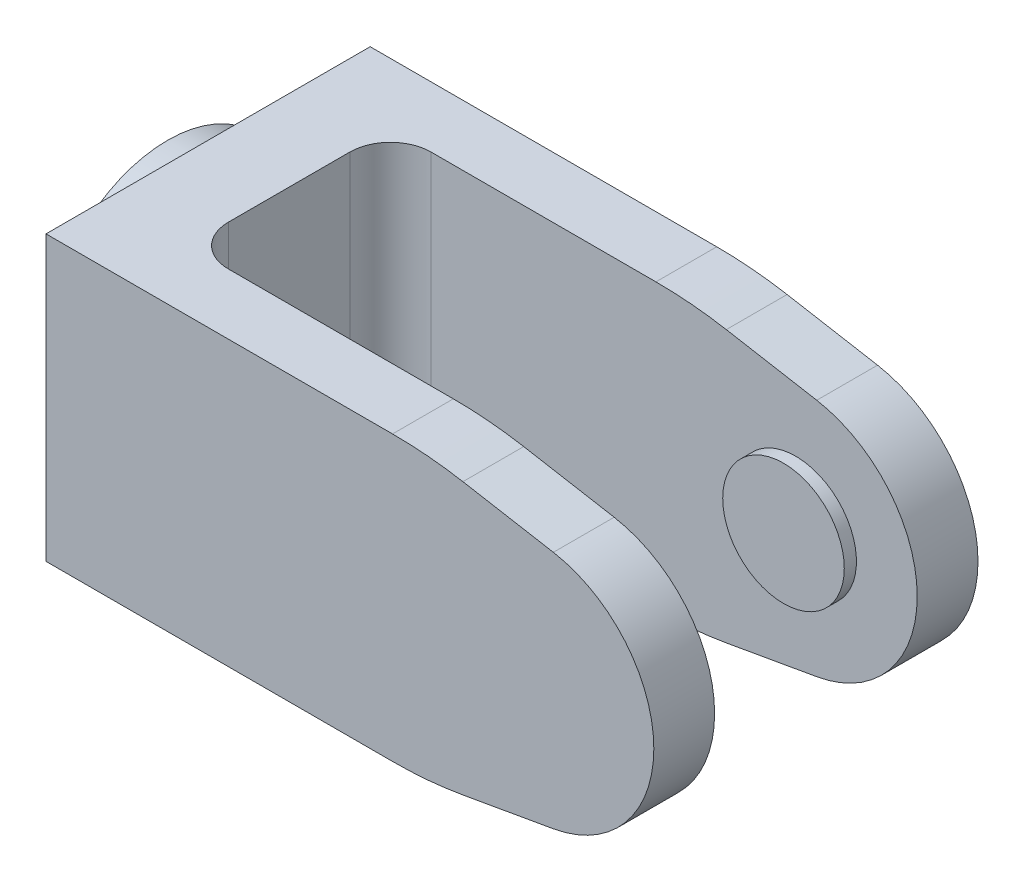
ISO-10303-21;
HEADER;
FILE_DESCRIPTION(('STEP AP214'),'2;1');
FILE_NAME('part.step','',(''),(''),'','','');
FILE_SCHEMA(('AUTOMOTIVE_DESIGN { 1 0 10303 214 1 1 1 1 }'));
ENDSEC;
DATA;
#1=APPLICATION_CONTEXT('core data for automotive mechanical design processes');
#2=APPLICATION_PROTOCOL_DEFINITION('international standard','automotive_design',2000,#1);
#3=PRODUCT_CONTEXT('',#1,'mechanical');
#4=PRODUCT('Part','Part','',(#3));
#5=PRODUCT_RELATED_PRODUCT_CATEGORY('part','',(#4));
#6=PRODUCT_DEFINITION_FORMATION('','',#4);
#7=PRODUCT_DEFINITION_CONTEXT('part definition',#1,'design');
#8=PRODUCT_DEFINITION('design','',#6,#7);
#9=PRODUCT_DEFINITION_SHAPE('','',#8);
#10=(LENGTH_UNIT() NAMED_UNIT(*) SI_UNIT(.MILLI.,.METRE.));
#11=(NAMED_UNIT(*) PLANE_ANGLE_UNIT() SI_UNIT($,.RADIAN.));
#12=(NAMED_UNIT(*) SI_UNIT($,.STERADIAN.) SOLID_ANGLE_UNIT());
#13=UNCERTAINTY_MEASURE_WITH_UNIT(LENGTH_MEASURE(1.E-05),#10,'distance_accuracy_value','');
#14=(GEOMETRIC_REPRESENTATION_CONTEXT(3) GLOBAL_UNCERTAINTY_ASSIGNED_CONTEXT((#13)) GLOBAL_UNIT_ASSIGNED_CONTEXT((#10,
#11,#12)) REPRESENTATION_CONTEXT('',''));
#15=CARTESIAN_POINT('',(0.,0.,0.));
#16=DIRECTION('',(0.,0.,1.));
#17=DIRECTION('',(1.,0.,0.));
#18=AXIS2_PLACEMENT_3D('',#15,#16,#17);
#19=CARTESIAN_POINT('',(65.8403220506079,-8.88482598258463,40.));
#20=DIRECTION('',(0.,0.,-1.));
#21=DIRECTION('',(-1.,0.,0.));
#22=AXIS2_PLACEMENT_3D('',#19,#20,#21);
#23=CYLINDRICAL_SURFACE('',#22,30.);
#24=CARTESIAN_POINT('',(65.8403220506079,-8.88482598258463,25.));
#25=DIRECTION('',(0.,0.,1.));
#26=DIRECTION('',(1.,0.,0.));
#27=AXIS2_PLACEMENT_3D('',#24,#25,#26);
#28=CIRCLE('',#27,30.);
#29=CARTESIAN_POINT('',(71.0497673806158,-38.4290585729509,25.));
#30=VERTEX_POINT('',#29);
#31=CARTESIAN_POINT('',(71.0497673806158,20.6594066077816,25.));
#32=VERTEX_POINT('',#31);
#33=EDGE_CURVE('E169',#30,#32,#28,.T.);
#34=ORIENTED_EDGE('',*,*,#33,.T.);
#35=DIRECTION('',(0.,0.,-1.));
#36=VECTOR('',#35,1.);
#37=CARTESIAN_POINT('',(71.0497673806158,20.6594066077816,40.));
#38=LINE('',#37,#36);
#39=CARTESIAN_POINT('',(71.0497673806158,20.6594066077816,40.));
#40=VERTEX_POINT('',#39);
#41=EDGE_CURVE('E185',#40,#32,#38,.T.);
#42=ORIENTED_EDGE('',*,*,#41,.F.);
#43=CARTESIAN_POINT('',(65.8403220506079,-8.88482598258463,40.));
#44=DIRECTION('',(0.,0.,1.));
#45=DIRECTION('',(1.,0.,0.));
#46=AXIS2_PLACEMENT_3D('',#43,#44,#45);
#47=CIRCLE('',#46,30.);
#48=CARTESIAN_POINT('',(71.0497673806158,-38.4290585729509,40.));
#49=VERTEX_POINT('',#48);
#50=EDGE_CURVE('E308',#49,#40,#47,.T.);
#51=ORIENTED_EDGE('',*,*,#50,.F.);
#52=DIRECTION('',(0.,0.,-1.));
#53=VECTOR('',#52,1.);
#54=CARTESIAN_POINT('',(71.0497673806158,-38.4290585729509,40.));
#55=LINE('',#54,#53);
#56=EDGE_CURVE('E195',#49,#30,#55,.T.);
#57=ORIENTED_EDGE('',*,*,#56,.T.);
#58=EDGE_LOOP('',(#34,#42,#51,#57));
#59=FACE_BOUND('',#58,.T.);
#60=ADVANCED_FACE('F33',(#59),#23,.T.);
#61=CARTESIAN_POINT('',(71.0497673806158,20.6594066077816,-25.));
#62=VERTEX_POINT('',#61);
#63=CARTESIAN_POINT('',(71.0497673806158,20.6594066077816,-40.));
#64=VERTEX_POINT('',#63);
#65=EDGE_CURVE('E174',#62,#64,#38,.T.);
#66=ORIENTED_EDGE('',*,*,#65,.F.);
#67=CARTESIAN_POINT('',(65.8403220506079,-8.88482598258463,-25.));
#68=DIRECTION('',(0.,0.,-1.));
#69=DIRECTION('',(-1.,0.,0.));
#70=AXIS2_PLACEMENT_3D('',#67,#68,#69);
#71=CIRCLE('',#70,30.);
#72=CARTESIAN_POINT('',(71.0497673806158,-38.4290585729509,-25.));
#73=VERTEX_POINT('',#72);
#74=EDGE_CURVE('E157',#62,#73,#71,.T.);
#75=ORIENTED_EDGE('',*,*,#74,.T.);
#76=CARTESIAN_POINT('',(71.0497673806158,-38.4290585729509,-40.));
#77=VERTEX_POINT('',#76);
#78=EDGE_CURVE('E189',#73,#77,#55,.T.);
#79=ORIENTED_EDGE('',*,*,#78,.T.);
#80=CARTESIAN_POINT('',(65.8403220506079,-8.88482598258463,-40.));
#81=DIRECTION('',(0.,0.,1.));
#82=DIRECTION('',(1.,0.,0.));
#83=AXIS2_PLACEMENT_3D('',#80,#81,#82);
#84=CIRCLE('',#83,30.);
#85=EDGE_CURVE('E183',#77,#64,#84,.T.);
#86=ORIENTED_EDGE('',*,*,#85,.T.);
#87=EDGE_LOOP('',(#66,#75,#79,#86));
#88=FACE_BOUND('',#87,.T.);
#89=ADVANCED_FACE('F181',(#88),#23,.T.);
#90=CARTESIAN_POINT('',(71.0497673806158,20.6594066077816,40.));
#91=DIRECTION('',(-0.173648177666931,-0.984807753012208,0.));
#92=DIRECTION('',(0.984807753012208,-0.173648177666931,0.));
#93=AXIS2_PLACEMENT_3D('',#90,#91,#92);
#94=PLANE('',#93);
#95=DIRECTION('',(0.984807753012208,-0.173648177666931,0.));
#96=VECTOR('',#95,1.);
#97=CARTESIAN_POINT('',(71.0497673806158,20.6594066077816,25.));
#98=LINE('',#97,#96);
#99=CARTESIAN_POINT('',(48.7245242723978,24.5959493186362,25.));
#100=VERTEX_POINT('',#99);
#101=EDGE_CURVE('E178',#100,#32,#98,.T.);
#102=ORIENTED_EDGE('',*,*,#101,.F.);
#103=DIRECTION('',(0.,0.,-1.));
#104=VECTOR('',#103,1.);
#105=CARTESIAN_POINT('',(48.7245242723978,24.5959493186362,40.));
#106=LINE('',#105,#104);
#107=CARTESIAN_POINT('',(48.7245242723978,24.5959493186362,40.));
#108=VERTEX_POINT('',#107);
#109=EDGE_CURVE('E215',#100,#108,#106,.F.);
#110=ORIENTED_EDGE('',*,*,#109,.T.);
#111=DIRECTION('',(-0.984807753012208,0.173648177666931,0.));
#112=VECTOR('',#111,1.);
#113=CARTESIAN_POINT('',(71.0497673806158,20.6594066077816,40.));
#114=LINE('',#113,#112);
#115=EDGE_CURVE('E310',#40,#108,#114,.T.);
#116=ORIENTED_EDGE('',*,*,#115,.F.);
#117=ORIENTED_EDGE('',*,*,#41,.T.);
#118=EDGE_LOOP('',(#102,#110,#116,#117));
#119=FACE_BOUND('',#118,.T.);
#120=ADVANCED_FACE('F346',(#119),#94,.F.);
#121=DIRECTION('',(-0.984807753012208,0.173648177666931,0.));
#122=VECTOR('',#121,1.);
#123=CARTESIAN_POINT('',(71.0497673806158,20.6594066077816,-40.));
#124=LINE('',#123,#122);
#125=CARTESIAN_POINT('',(48.7245242723978,24.5959493186362,-40.));
#126=VERTEX_POINT('',#125);
#127=EDGE_CURVE('E321',#64,#126,#124,.T.);
#128=ORIENTED_EDGE('',*,*,#127,.T.);
#129=DIRECTION('',(0.,0.,-1.));
#130=VECTOR('',#129,1.);
#131=CARTESIAN_POINT('',(48.7245242723978,24.5959493186362,40.));
#132=LINE('',#131,#130);
#133=CARTESIAN_POINT('',(48.7245242723978,24.5959493186362,-25.));
#134=VERTEX_POINT('',#133);
#135=EDGE_CURVE('E177',#126,#134,#132,.F.);
#136=ORIENTED_EDGE('',*,*,#135,.T.);
#137=DIRECTION('',(-0.984807753012208,0.173648177666931,0.));
#138=VECTOR('',#137,1.);
#139=CARTESIAN_POINT('',(71.0497673806158,20.6594066077816,-25.));
#140=LINE('',#139,#138);
#141=EDGE_CURVE('E160',#62,#134,#140,.T.);
#142=ORIENTED_EDGE('',*,*,#141,.F.);
#143=ORIENTED_EDGE('',*,*,#65,.T.);
#144=EDGE_LOOP('',(#128,#136,#142,#143));
#145=FACE_BOUND('',#144,.T.);
#146=ADVANCED_FACE('F173',(#145),#94,.F.);
#147=CARTESIAN_POINT('',(40.1085728582971,26.1151740174154,40.));
#148=DIRECTION('',(0.,-1.,0.));
#149=DIRECTION('',(1.,0.,0.));
#150=AXIS2_PLACEMENT_3D('',#147,#148,#149);
#151=PLANE('',#150);
#152=DIRECTION('',(-1.,0.,0.));
#153=VECTOR('',#152,1.);
#154=CARTESIAN_POINT('',(40.1085728582971,26.1151740174154,40.));
#155=LINE('',#154,#153);
#156=CARTESIAN_POINT('',(31.3597065057047,26.1151740174154,40.));
#157=VERTEX_POINT('',#156);
#158=CARTESIAN_POINT('',(-54.1596779493921,26.1151740174154,40.));
#159=VERTEX_POINT('',#158);
#160=EDGE_CURVE('E191',#157,#159,#155,.T.);
#161=ORIENTED_EDGE('',*,*,#160,.F.);
#162=DIRECTION('',(0.,0.,-1.));
#163=VECTOR('',#162,1.);
#164=CARTESIAN_POINT('',(31.3597065057047,26.1151740174154,40.));
#165=LINE('',#164,#163);
#166=CARTESIAN_POINT('',(31.3597065057046,26.1151740174154,25.));
#167=VERTEX_POINT('',#166);
#168=EDGE_CURVE('E209',#157,#167,#165,.T.);
#169=ORIENTED_EDGE('',*,*,#168,.T.);
#170=DIRECTION('',(1.,0.,0.));
#171=VECTOR('',#170,1.);
#172=CARTESIAN_POINT('',(-34.1596779493921,26.1151740174154,25.));
#173=LINE('',#172,#171);
#174=CARTESIAN_POINT('',(-24.1596779493921,26.1151740174154,25.));
#175=VERTEX_POINT('',#174);
#176=EDGE_CURVE('E279',#175,#167,#173,.T.);
#177=ORIENTED_EDGE('',*,*,#176,.F.);
#178=CARTESIAN_POINT('',(-24.1596779493921,26.1151740174154,15.));
#179=DIRECTION('',(0.,-1.,0.));
#180=DIRECTION('',(1.,0.,0.));
#181=AXIS2_PLACEMENT_3D('',#178,#179,#180);
#182=CIRCLE('',#181,10.);
#183=CARTESIAN_POINT('',(-34.1596779493921,26.1151740174154,15.));
#184=VERTEX_POINT('',#183);
#185=EDGE_CURVE('E252',#175,#184,#182,.T.);
#186=ORIENTED_EDGE('',*,*,#185,.T.);
#187=DIRECTION('',(0.,0.,1.));
#188=VECTOR('',#187,1.);
#189=CARTESIAN_POINT('',(-34.1596779493921,26.1151740174154,-25.));
#190=LINE('',#189,#188);
#191=CARTESIAN_POINT('',(-34.1596779493921,26.1151740174154,-15.));
#192=VERTEX_POINT('',#191);
#193=EDGE_CURVE('E278',#192,#184,#190,.T.);
#194=ORIENTED_EDGE('',*,*,#193,.F.);
#195=CARTESIAN_POINT('',(-24.1596779493921,26.1151740174154,-15.));
#196=DIRECTION('',(0.,-1.,0.));
#197=DIRECTION('',(1.,0.,0.));
#198=AXIS2_PLACEMENT_3D('',#195,#196,#197);
#199=CIRCLE('',#198,10.);
#200=CARTESIAN_POINT('',(-24.1596779493921,26.1151740174154,-25.));
#201=VERTEX_POINT('',#200);
#202=EDGE_CURVE('E41',#192,#201,#199,.T.);
#203=ORIENTED_EDGE('',*,*,#202,.T.);
#204=DIRECTION('',(-1.,0.,0.));
#205=VECTOR('',#204,1.);
#206=CARTESIAN_POINT('',(-34.1596779493921,26.1151740174154,-25.));
#207=LINE('',#206,#205);
#208=CARTESIAN_POINT('',(31.3597065057047,26.1151740174154,-25.));
#209=VERTEX_POINT('',#208);
#210=EDGE_CURVE('E179',#209,#201,#207,.T.);
#211=ORIENTED_EDGE('',*,*,#210,.F.);
#212=DIRECTION('',(0.,0.,-1.));
#213=VECTOR('',#212,1.);
#214=CARTESIAN_POINT('',(31.3597065057047,26.1151740174154,40.));
#215=LINE('',#214,#213);
#216=CARTESIAN_POINT('',(31.3597065057047,26.1151740174154,-40.));
#217=VERTEX_POINT('',#216);
#218=EDGE_CURVE('E206',#209,#217,#215,.T.);
#219=ORIENTED_EDGE('',*,*,#218,.T.);
#220=DIRECTION('',(-1.,0.,0.));
#221=VECTOR('',#220,1.);
#222=CARTESIAN_POINT('',(40.1085728582971,26.1151740174154,-40.));
#223=LINE('',#222,#221);
#224=CARTESIAN_POINT('',(-54.1596779493921,26.1151740174154,-40.));
#225=VERTEX_POINT('',#224);
#226=EDGE_CURVE('E303',#217,#225,#223,.T.);
#227=ORIENTED_EDGE('',*,*,#226,.T.);
#228=DIRECTION('',(0.,0.,-1.));
#229=VECTOR('',#228,1.);
#230=CARTESIAN_POINT('',(-54.1596779493921,26.1151740174154,40.));
#231=LINE('',#230,#229);
#232=EDGE_CURVE('E186',#159,#225,#231,.T.);
#233=ORIENTED_EDGE('',*,*,#232,.F.);
#234=EDGE_LOOP('',(#161,#169,#177,#186,#194,#203,#211,#219,#227,#233));
#235=FACE_BOUND('',#234,.T.);
#236=ADVANCED_FACE('F277',(#235),#151,.F.);
#237=CARTESIAN_POINT('',(40.1085728582971,-43.8848259825847,40.));
#238=DIRECTION('',(-0.173648177666931,0.984807753012208,0.));
#239=DIRECTION('',(-0.984807753012208,-0.173648177666931,0.));
#240=AXIS2_PLACEMENT_3D('',#237,#238,#239);
#241=PLANE('',#240);
#242=DIRECTION('',(-0.984807753012208,-0.173648177666931,0.));
#243=VECTOR('',#242,1.);
#244=CARTESIAN_POINT('',(40.1085728582971,-43.8848259825847,-25.));
#245=LINE('',#244,#243);
#246=CARTESIAN_POINT('',(48.7245242723978,-42.3656012838055,-25.));
#247=VERTEX_POINT('',#246);
#248=EDGE_CURVE('E163',#73,#247,#245,.T.);
#249=ORIENTED_EDGE('',*,*,#248,.T.);
#250=DIRECTION('',(0.,0.,-1.));
#251=VECTOR('',#250,1.);
#252=CARTESIAN_POINT('',(48.7245242723978,-42.3656012838055,40.));
#253=LINE('',#252,#251);
#254=CARTESIAN_POINT('',(48.7245242723978,-42.3656012838055,-40.));
#255=VERTEX_POINT('',#254);
#256=EDGE_CURVE('E224',#247,#255,#253,.T.);
#257=ORIENTED_EDGE('',*,*,#256,.T.);
#258=DIRECTION('',(0.984807753012208,0.173648177666931,0.));
#259=VECTOR('',#258,1.);
#260=CARTESIAN_POINT('',(40.1085728582971,-43.8848259825847,-40.));
#261=LINE('',#260,#259);
#262=EDGE_CURVE('E318',#255,#77,#261,.T.);
#263=ORIENTED_EDGE('',*,*,#262,.T.);
#264=ORIENTED_EDGE('',*,*,#78,.F.);
#265=EDGE_LOOP('',(#249,#257,#263,#264));
#266=FACE_BOUND('',#265,.T.);
#267=ADVANCED_FACE('F378',(#266),#241,.F.);
#268=CARTESIAN_POINT('',(-54.1596779493921,26.1151740174154,40.));
#269=DIRECTION('',(1.,0.,0.));
#270=DIRECTION('',(0.,1.,0.));
#271=AXIS2_PLACEMENT_3D('',#268,#269,#270);
#272=PLANE('',#271);
#273=CARTESIAN_POINT('',(-54.1596779493921,-8.88482598258465,0.));
#274=DIRECTION('',(-1.,0.,0.));
#275=DIRECTION('',(0.,-1.,0.));
#276=AXIS2_PLACEMENT_3D('',#273,#274,#275);
#277=CIRCLE('',#276,30.);
#278=CARTESIAN_POINT('',(-54.1596779493921,-38.8848259825847,0.));
#279=VERTEX_POINT('',#278);
#280=EDGE_CURVE('E205',#279,#279,#277,.T.);
#281=ORIENTED_EDGE('',*,*,#280,.F.);
#282=EDGE_LOOP('',(#281));
#283=FACE_BOUND('',#282,.T.);
#284=DIRECTION('',(0.,-1.,0.));
#285=VECTOR('',#284,1.);
#286=CARTESIAN_POINT('',(-54.1596779493921,26.1151740174154,-40.));
#287=LINE('',#286,#285);
#288=CARTESIAN_POINT('',(-54.1596779493921,-43.8848259825847,-40.));
#289=VERTEX_POINT('',#288);
#290=EDGE_CURVE('E298',#225,#289,#287,.T.);
#291=ORIENTED_EDGE('',*,*,#290,.T.);
#292=DIRECTION('',(0.,0.,-1.));
#293=VECTOR('',#292,1.);
#294=CARTESIAN_POINT('',(-54.1596779493921,-43.8848259825847,40.));
#295=LINE('',#294,#293);
#296=CARTESIAN_POINT('',(-54.1596779493921,-43.8848259825847,40.));
#297=VERTEX_POINT('',#296);
#298=EDGE_CURVE('E198',#297,#289,#295,.T.);
#299=ORIENTED_EDGE('',*,*,#298,.F.);
#300=DIRECTION('',(0.,-1.,0.));
#301=VECTOR('',#300,1.);
#302=CARTESIAN_POINT('',(-54.1596779493921,26.1151740174154,40.));
#303=LINE('',#302,#301);
#304=EDGE_CURVE('E299',#159,#297,#303,.T.);
#305=ORIENTED_EDGE('',*,*,#304,.F.);
#306=ORIENTED_EDGE('',*,*,#232,.T.);
#307=EDGE_LOOP('',(#291,#299,#305,#306));
#308=FACE_BOUND('',#307,.T.);
#309=ADVANCED_FACE('F329',(#283,#308),#272,.F.);
#310=CARTESIAN_POINT('',(-54.1596779493921,-43.8848259825847,40.));
#311=DIRECTION('',(0.,1.,0.));
#312=DIRECTION('',(0.,0.,1.));
#313=AXIS2_PLACEMENT_3D('',#310,#311,#312);
#314=PLANE('',#313);
#315=DIRECTION('',(1.,0.,0.));
#316=VECTOR('',#315,1.);
#317=CARTESIAN_POINT('',(-54.1596779493921,-43.8848259825847,-40.));
#318=LINE('',#317,#316);
#319=CARTESIAN_POINT('',(31.3597065057046,-43.8848259825847,-40.));
#320=VERTEX_POINT('',#319);
#321=EDGE_CURVE('E316',#289,#320,#318,.T.);
#322=ORIENTED_EDGE('',*,*,#321,.T.);
#323=DIRECTION('',(0.,0.,-1.));
#324=VECTOR('',#323,1.);
#325=CARTESIAN_POINT('',(31.3597065057046,-43.8848259825847,40.));
#326=LINE('',#325,#324);
#327=CARTESIAN_POINT('',(31.3597065057046,-43.8848259825847,-25.));
#328=VERTEX_POINT('',#327);
#329=EDGE_CURVE('E231',#320,#328,#326,.F.);
#330=ORIENTED_EDGE('',*,*,#329,.T.);
#331=DIRECTION('',(-1.,0.,0.));
#332=VECTOR('',#331,1.);
#333=CARTESIAN_POINT('',(-34.1596779493921,-43.8848259825847,-25.));
#334=LINE('',#333,#332);
#335=CARTESIAN_POINT('',(-24.1596779493921,-43.8848259825847,-25.));
#336=VERTEX_POINT('',#335);
#337=EDGE_CURVE('E272',#328,#336,#334,.T.);
#338=ORIENTED_EDGE('',*,*,#337,.T.);
#339=CARTESIAN_POINT('',(-24.1596779493921,-43.8848259825847,-15.));
#340=DIRECTION('',(0.,1.,0.));
#341=DIRECTION('',(0.,0.,1.));
#342=AXIS2_PLACEMENT_3D('',#339,#340,#341);
#343=CIRCLE('',#342,10.);
#344=CARTESIAN_POINT('',(-34.1596779493921,-43.8848259825847,-15.));
#345=VERTEX_POINT('',#344);
#346=EDGE_CURVE('E11',#336,#345,#343,.T.);
#347=ORIENTED_EDGE('',*,*,#346,.T.);
#348=DIRECTION('',(0.,0.,1.));
#349=VECTOR('',#348,1.);
#350=CARTESIAN_POINT('',(-34.1596779493921,-43.8848259825847,-25.));
#351=LINE('',#350,#349);
#352=CARTESIAN_POINT('',(-34.1596779493921,-43.8848259825847,15.));
#353=VERTEX_POINT('',#352);
#354=EDGE_CURVE('E263',#345,#353,#351,.T.);
#355=ORIENTED_EDGE('',*,*,#354,.T.);
#356=CARTESIAN_POINT('',(-24.1596779493921,-43.8848259825847,15.));
#357=DIRECTION('',(0.,1.,0.));
#358=DIRECTION('',(0.,0.,1.));
#359=AXIS2_PLACEMENT_3D('',#356,#357,#358);
#360=CIRCLE('',#359,10.);
#361=CARTESIAN_POINT('',(-24.1596779493921,-43.8848259825847,25.));
#362=VERTEX_POINT('',#361);
#363=EDGE_CURVE('E254',#353,#362,#360,.T.);
#364=ORIENTED_EDGE('',*,*,#363,.T.);
#365=DIRECTION('',(1.,0.,0.));
#366=VECTOR('',#365,1.);
#367=CARTESIAN_POINT('',(-34.1596779493921,-43.8848259825847,25.));
#368=LINE('',#367,#366);
#369=CARTESIAN_POINT('',(31.3597065057046,-43.8848259825847,25.));
#370=VERTEX_POINT('',#369);
#371=EDGE_CURVE('E261',#362,#370,#368,.T.);
#372=ORIENTED_EDGE('',*,*,#371,.T.);
#373=DIRECTION('',(0.,0.,-1.));
#374=VECTOR('',#373,1.);
#375=CARTESIAN_POINT('',(31.3597065057046,-43.8848259825847,40.));
#376=LINE('',#375,#374);
#377=CARTESIAN_POINT('',(31.3597065057046,-43.8848259825847,40.));
#378=VERTEX_POINT('',#377);
#379=EDGE_CURVE('E229',#370,#378,#376,.F.);
#380=ORIENTED_EDGE('',*,*,#379,.T.);
#381=DIRECTION('',(1.,0.,0.));
#382=VECTOR('',#381,1.);
#383=CARTESIAN_POINT('',(-54.1596779493921,-43.8848259825847,40.));
#384=LINE('',#383,#382);
#385=EDGE_CURVE('E302',#297,#378,#384,.T.);
#386=ORIENTED_EDGE('',*,*,#385,.F.);
#387=ORIENTED_EDGE('',*,*,#298,.T.);
#388=EDGE_LOOP('',(#322,#330,#338,#347,#355,#364,#372,#380,#386,#387));
#389=FACE_BOUND('',#388,.T.);
#390=ADVANCED_FACE('F260',(#389),#314,.F.);
#391=DIRECTION('',(0.984807753012208,0.173648177666931,0.));
#392=VECTOR('',#391,1.);
#393=CARTESIAN_POINT('',(40.1085728582971,-43.8848259825847,40.));
#394=LINE('',#393,#392);
#395=CARTESIAN_POINT('',(48.7245242723978,-42.3656012838055,40.));
#396=VERTEX_POINT('',#395);
#397=EDGE_CURVE('E306',#396,#49,#394,.T.);
#398=ORIENTED_EDGE('',*,*,#397,.F.);
#399=DIRECTION('',(0.,0.,-1.));
#400=VECTOR('',#399,1.);
#401=CARTESIAN_POINT('',(48.7245242723978,-42.3656012838055,40.));
#402=LINE('',#401,#400);
#403=CARTESIAN_POINT('',(48.7245242723978,-42.3656012838055,25.));
#404=VERTEX_POINT('',#403);
#405=EDGE_CURVE('E235',#396,#404,#402,.T.);
#406=ORIENTED_EDGE('',*,*,#405,.T.);
#407=DIRECTION('',(0.984807753012208,0.173648177666931,0.));
#408=VECTOR('',#407,1.);
#409=CARTESIAN_POINT('',(40.1085728582971,-43.8848259825847,25.));
#410=LINE('',#409,#408);
#411=EDGE_CURVE('E295',#404,#30,#410,.T.);
#412=ORIENTED_EDGE('',*,*,#411,.T.);
#413=ORIENTED_EDGE('',*,*,#56,.F.);
#414=EDGE_LOOP('',(#398,#406,#412,#413));
#415=FACE_BOUND('',#414,.T.);
#416=ADVANCED_FACE('F354',(#415),#241,.F.);
#417=CARTESIAN_POINT('',(65.8403220506079,-8.88482598258463,40.));
#418=DIRECTION('',(0.,0.,1.));
#419=DIRECTION('',(1.,0.,0.));
#420=AXIS2_PLACEMENT_3D('',#417,#418,#419);
#421=PLANE('',#420);
#422=ORIENTED_EDGE('',*,*,#385,.T.);
#423=CARTESIAN_POINT('',(31.3597065057046,56.1151740174153,40.));
#424=DIRECTION('',(0.,0.,1.));
#425=DIRECTION('',(1.,0.,0.));
#426=AXIS2_PLACEMENT_3D('',#423,#424,#425);
#427=CIRCLE('',#426,100.);
#428=EDGE_CURVE('E241',#378,#396,#427,.T.);
#429=ORIENTED_EDGE('',*,*,#428,.T.);
#430=ORIENTED_EDGE('',*,*,#397,.T.);
#431=ORIENTED_EDGE('',*,*,#50,.T.);
#432=ORIENTED_EDGE('',*,*,#115,.T.);
#433=CARTESIAN_POINT('',(31.3597065057047,-73.8848259825846,40.));
#434=DIRECTION('',(0.,0.,1.));
#435=DIRECTION('',(1.,0.,0.));
#436=AXIS2_PLACEMENT_3D('',#433,#434,#435);
#437=CIRCLE('',#436,100.);
#438=EDGE_CURVE('E217',#108,#157,#437,.T.);
#439=ORIENTED_EDGE('',*,*,#438,.T.);
#440=ORIENTED_EDGE('',*,*,#160,.T.);
#441=ORIENTED_EDGE('',*,*,#304,.T.);
#442=EDGE_LOOP('',(#422,#429,#430,#431,#432,#439,#440,#441));
#443=FACE_BOUND('',#442,.T.);
#444=ADVANCED_FACE('F336',(#443),#421,.T.);
#445=CARTESIAN_POINT('',(65.8403220506079,-8.88482598258463,-40.));
#446=DIRECTION('',(0.,0.,1.));
#447=DIRECTION('',(1.,0.,0.));
#448=AXIS2_PLACEMENT_3D('',#445,#446,#447);
#449=PLANE('',#448);
#450=ORIENTED_EDGE('',*,*,#262,.F.);
#451=CARTESIAN_POINT('',(31.3597065057046,56.1151740174153,-40.));
#452=DIRECTION('',(0.,0.,1.));
#453=DIRECTION('',(1.,0.,0.));
#454=AXIS2_PLACEMENT_3D('',#451,#452,#453);
#455=CIRCLE('',#454,100.);
#456=EDGE_CURVE('E227',#255,#320,#455,.F.);
#457=ORIENTED_EDGE('',*,*,#456,.T.);
#458=ORIENTED_EDGE('',*,*,#321,.F.);
#459=ORIENTED_EDGE('',*,*,#290,.F.);
#460=ORIENTED_EDGE('',*,*,#226,.F.);
#461=CARTESIAN_POINT('',(31.3597065057047,-73.8848259825846,-40.));
#462=DIRECTION('',(0.,0.,1.));
#463=DIRECTION('',(1.,0.,0.));
#464=AXIS2_PLACEMENT_3D('',#461,#462,#463);
#465=CIRCLE('',#464,100.);
#466=EDGE_CURVE('E219',#217,#126,#465,.F.);
#467=ORIENTED_EDGE('',*,*,#466,.T.);
#468=ORIENTED_EDGE('',*,*,#127,.F.);
#469=ORIENTED_EDGE('',*,*,#85,.F.);
#470=EDGE_LOOP('',(#450,#457,#458,#459,#460,#467,#468,#469));
#471=FACE_BOUND('',#470,.T.);
#472=ADVANCED_FACE('F332',(#471),#449,.F.);
#473=CARTESIAN_POINT('',(-34.1596779493921,-43.8848259825847,-25.));
#474=DIRECTION('',(0.,0.,-1.));
#475=DIRECTION('',(-1.,0.,0.));
#476=AXIS2_PLACEMENT_3D('',#473,#474,#475);
#477=PLANE('',#476);
#478=CARTESIAN_POINT('',(65.8403220506079,-8.88482598258463,-25.));
#479=DIRECTION('',(0.,0.,-1.));
#480=DIRECTION('',(-1.,0.,0.));
#481=AXIS2_PLACEMENT_3D('',#478,#479,#480);
#482=CIRCLE('',#481,15.);
#483=CARTESIAN_POINT('',(50.8403220506079,-8.88482598258463,-25.));
#484=VERTEX_POINT('',#483);
#485=EDGE_CURVE('E168',#484,#484,#482,.F.);
#486=ORIENTED_EDGE('',*,*,#485,.F.);
#487=EDGE_LOOP('',(#486));
#488=FACE_BOUND('',#487,.T.);
#489=ORIENTED_EDGE('',*,*,#210,.T.);
#490=DIRECTION('',(0.,1.,0.));
#491=VECTOR('',#490,1.);
#492=CARTESIAN_POINT('',(-24.1596779493921,-43.8848259825847,-25.));
#493=LINE('',#492,#491);
#494=EDGE_CURVE('E54',#201,#336,#493,.F.);
#495=ORIENTED_EDGE('',*,*,#494,.T.);
#496=ORIENTED_EDGE('',*,*,#337,.F.);
#497=CARTESIAN_POINT('',(31.3597065057046,56.1151740174153,-25.));
#498=DIRECTION('',(0.,0.,-1.));
#499=DIRECTION('',(-1.,0.,0.));
#500=AXIS2_PLACEMENT_3D('',#497,#498,#499);
#501=CIRCLE('',#500,100.);
#502=EDGE_CURVE('E233',#328,#247,#501,.F.);
#503=ORIENTED_EDGE('',*,*,#502,.T.);
#504=ORIENTED_EDGE('',*,*,#248,.F.);
#505=ORIENTED_EDGE('',*,*,#74,.F.);
#506=ORIENTED_EDGE('',*,*,#141,.T.);
#507=CARTESIAN_POINT('',(31.3597065057047,-73.8848259825846,-25.));
#508=DIRECTION('',(0.,0.,-1.));
#509=DIRECTION('',(-1.,0.,0.));
#510=AXIS2_PLACEMENT_3D('',#507,#508,#509);
#511=CIRCLE('',#510,100.);
#512=EDGE_CURVE('E222',#134,#209,#511,.F.);
#513=ORIENTED_EDGE('',*,*,#512,.T.);
#514=EDGE_LOOP('',(#489,#495,#496,#503,#504,#505,#506,#513));
#515=FACE_BOUND('',#514,.T.);
#516=ADVANCED_FACE('F159',(#488,#515),#477,.F.);
#517=CARTESIAN_POINT('',(-34.1596779493921,-43.8848259825847,25.));
#518=DIRECTION('',(0.,0.,1.));
#519=DIRECTION('',(1.,0.,0.));
#520=AXIS2_PLACEMENT_3D('',#517,#518,#519);
#521=PLANE('',#520);
#522=CARTESIAN_POINT('',(65.8403220506079,-8.88482598258463,25.));
#523=DIRECTION('',(0.,0.,1.));
#524=DIRECTION('',(1.,0.,0.));
#525=AXIS2_PLACEMENT_3D('',#522,#523,#524);
#526=CIRCLE('',#525,15.);
#527=CARTESIAN_POINT('',(80.8403220506079,-8.88482598258463,25.));
#528=VERTEX_POINT('',#527);
#529=EDGE_CURVE('E454',#528,#528,#526,.T.);
#530=ORIENTED_EDGE('',*,*,#529,.T.);
#531=EDGE_LOOP('',(#530));
#532=FACE_BOUND('',#531,.T.);
#533=ORIENTED_EDGE('',*,*,#371,.F.);
#534=DIRECTION('',(0.,1.,0.));
#535=VECTOR('',#534,1.);
#536=CARTESIAN_POINT('',(-24.1596779493921,26.1151740174154,25.));
#537=LINE('',#536,#535);
#538=EDGE_CURVE('E243',#362,#175,#537,.T.);
#539=ORIENTED_EDGE('',*,*,#538,.T.);
#540=ORIENTED_EDGE('',*,*,#176,.T.);
#541=CARTESIAN_POINT('',(31.3597065057047,-73.8848259825846,25.));
#542=DIRECTION('',(0.,0.,1.));
#543=DIRECTION('',(1.,0.,0.));
#544=AXIS2_PLACEMENT_3D('',#541,#542,#543);
#545=CIRCLE('',#544,100.);
#546=EDGE_CURVE('E213',#167,#100,#545,.F.);
#547=ORIENTED_EDGE('',*,*,#546,.T.);
#548=ORIENTED_EDGE('',*,*,#101,.T.);
#549=ORIENTED_EDGE('',*,*,#33,.F.);
#550=ORIENTED_EDGE('',*,*,#411,.F.);
#551=CARTESIAN_POINT('',(31.3597065057046,56.1151740174153,25.));
#552=DIRECTION('',(0.,0.,1.));
#553=DIRECTION('',(1.,0.,0.));
#554=AXIS2_PLACEMENT_3D('',#551,#552,#553);
#555=CIRCLE('',#554,100.);
#556=EDGE_CURVE('E238',#404,#370,#555,.F.);
#557=ORIENTED_EDGE('',*,*,#556,.T.);
#558=EDGE_LOOP('',(#533,#539,#540,#547,#548,#549,#550,#557));
#559=FACE_BOUND('',#558,.T.);
#560=ADVANCED_FACE('F268',(#532,#559),#521,.F.);
#561=CARTESIAN_POINT('',(-34.1596779493921,-43.8848259825847,-25.));
#562=DIRECTION('',(-1.,0.,0.));
#563=DIRECTION('',(0.,0.,1.));
#564=AXIS2_PLACEMENT_3D('',#561,#562,#563);
#565=PLANE('',#564);
#566=ORIENTED_EDGE('',*,*,#193,.T.);
#567=DIRECTION('',(0.,1.,0.));
#568=VECTOR('',#567,1.);
#569=CARTESIAN_POINT('',(-34.1596779493921,-43.8848259825847,15.));
#570=LINE('',#569,#568);
#571=EDGE_CURVE('E249',#184,#353,#570,.F.);
#572=ORIENTED_EDGE('',*,*,#571,.T.);
#573=ORIENTED_EDGE('',*,*,#354,.F.);
#574=DIRECTION('',(0.,1.,0.));
#575=VECTOR('',#574,1.);
#576=CARTESIAN_POINT('',(-34.1596779493921,26.1151740174154,-15.));
#577=LINE('',#576,#575);
#578=EDGE_CURVE('E246',#345,#192,#577,.T.);
#579=ORIENTED_EDGE('',*,*,#578,.T.);
#580=EDGE_LOOP('',(#566,#572,#573,#579));
#581=FACE_BOUND('',#580,.T.);
#582=ADVANCED_FACE('F281',(#581),#565,.F.);
#583=CARTESIAN_POINT('',(65.8403220506079,-8.88482598258463,-22.));
#584=DIRECTION('',(0.,0.,-1.));
#585=DIRECTION('',(-1.,0.,0.));
#586=AXIS2_PLACEMENT_3D('',#583,#584,#585);
#587=CYLINDRICAL_SURFACE('',#586,15.);
#588=CARTESIAN_POINT('',(65.8403220506079,-8.88482598258463,-22.));
#589=DIRECTION('',(0.,0.,1.));
#590=DIRECTION('',(1.,0.,0.));
#591=AXIS2_PLACEMENT_3D('',#588,#589,#590);
#592=CIRCLE('',#591,15.);
#593=CARTESIAN_POINT('',(80.8403220506079,-8.88482598258463,-22.));
#594=VERTEX_POINT('',#593);
#595=EDGE_CURVE('E283',#594,#594,#592,.T.);
#596=ORIENTED_EDGE('',*,*,#595,.F.);
#597=EDGE_LOOP('',(#596));
#598=FACE_BOUND('',#597,.T.);
#599=ORIENTED_EDGE('',*,*,#485,.T.);
#600=EDGE_LOOP('',(#599));
#601=FACE_BOUND('',#600,.T.);
#602=ADVANCED_FACE('F410',(#598,#601),#587,.T.);
#603=CARTESIAN_POINT('',(65.8403220506079,-8.88482598258463,-22.));
#604=DIRECTION('',(0.,0.,1.));
#605=DIRECTION('',(1.,0.,0.));
#606=AXIS2_PLACEMENT_3D('',#603,#604,#605);
#607=PLANE('',#606);
#608=ORIENTED_EDGE('',*,*,#595,.T.);
#609=EDGE_LOOP('',(#608));
#610=FACE_BOUND('',#609,.T.);
#611=ADVANCED_FACE('F419',(#610),#607,.T.);
#612=CARTESIAN_POINT('',(65.8403220506079,-8.88482598258463,22.));
#613=DIRECTION('',(0.,0.,1.));
#614=DIRECTION('',(1.,0.,0.));
#615=AXIS2_PLACEMENT_3D('',#612,#613,#614);
#616=CYLINDRICAL_SURFACE('',#615,15.);
#617=CARTESIAN_POINT('',(65.8403220506079,-8.88482598258463,22.));
#618=DIRECTION('',(0.,0.,1.));
#619=DIRECTION('',(1.,0.,0.));
#620=AXIS2_PLACEMENT_3D('',#617,#618,#619);
#621=CIRCLE('',#620,15.);
#622=CARTESIAN_POINT('',(80.8403220506079,-8.88482598258463,22.));
#623=VERTEX_POINT('',#622);
#624=EDGE_CURVE('E287',#623,#623,#621,.T.);
#625=ORIENTED_EDGE('',*,*,#624,.T.);
#626=EDGE_LOOP('',(#625));
#627=FACE_BOUND('',#626,.T.);
#628=ORIENTED_EDGE('',*,*,#529,.F.);
#629=EDGE_LOOP('',(#628));
#630=FACE_BOUND('',#629,.T.);
#631=ADVANCED_FACE('F423',(#627,#630),#616,.T.);
#632=CARTESIAN_POINT('',(65.8403220506079,-8.88482598258463,22.));
#633=DIRECTION('',(0.,0.,-1.));
#634=DIRECTION('',(1.,0.,0.));
#635=AXIS2_PLACEMENT_3D('',#632,#633,#634);
#636=PLANE('',#635);
#637=ORIENTED_EDGE('',*,*,#624,.F.);
#638=EDGE_LOOP('',(#637));
#639=FACE_BOUND('',#638,.T.);
#640=ADVANCED_FACE('F427',(#639),#636,.T.);
#641=CARTESIAN_POINT('',(-64.1596779493921,-8.88482598258465,0.));
#642=DIRECTION('',(1.,0.,0.));
#643=DIRECTION('',(0.,1.,0.));
#644=AXIS2_PLACEMENT_3D('',#641,#642,#643);
#645=CYLINDRICAL_SURFACE('',#644,30.);
#646=CARTESIAN_POINT('',(-64.1596779493921,-8.88482598258465,0.));
#647=DIRECTION('',(-1.,0.,0.));
#648=DIRECTION('',(0.,-1.,0.));
#649=AXIS2_PLACEMENT_3D('',#646,#647,#648);
#650=CIRCLE('',#649,30.);
#651=CARTESIAN_POINT('',(-64.1596779493921,-38.8848259825847,0.));
#652=VERTEX_POINT('',#651);
#653=EDGE_CURVE('E451',#652,#652,#650,.T.);
#654=ORIENTED_EDGE('',*,*,#653,.F.);
#655=EDGE_LOOP('',(#654));
#656=FACE_BOUND('',#655,.T.);
#657=ORIENTED_EDGE('',*,*,#280,.T.);
#658=EDGE_LOOP('',(#657));
#659=FACE_BOUND('',#658,.T.);
#660=ADVANCED_FACE('F431',(#656,#659),#645,.T.);
#661=CARTESIAN_POINT('',(-64.1596779493921,-8.88482598258465,0.));
#662=DIRECTION('',(-1.,0.,0.));
#663=DIRECTION('',(0.,-1.,0.));
#664=AXIS2_PLACEMENT_3D('',#661,#662,#663);
#665=PLANE('',#664);
#666=CARTESIAN_POINT('',(-64.1596779493921,-8.88482598258466,0.));
#667=DIRECTION('',(-1.,0.,0.));
#668=DIRECTION('',(0.,-1.,0.));
#669=AXIS2_PLACEMENT_3D('',#666,#667,#668);
#670=CIRCLE('',#669,25.);
#671=CARTESIAN_POINT('',(-64.1596779493921,-33.8848259825847,0.));
#672=VERTEX_POINT('',#671);
#673=EDGE_CURVE('E210',#672,#672,#670,.T.);
#674=ORIENTED_EDGE('',*,*,#673,.F.);
#675=EDGE_LOOP('',(#674));
#676=FACE_BOUND('',#675,.T.);
#677=ORIENTED_EDGE('',*,*,#653,.T.);
#678=EDGE_LOOP('',(#677));
#679=FACE_BOUND('',#678,.T.);
#680=ADVANCED_FACE('F435',(#676,#679),#665,.T.);
#681=CARTESIAN_POINT('',(-67.1596779493921,-8.88482598258466,0.));
#682=DIRECTION('',(1.,0.,0.));
#683=DIRECTION('',(0.,1.,0.));
#684=AXIS2_PLACEMENT_3D('',#681,#682,#683);
#685=CYLINDRICAL_SURFACE('',#684,25.);
#686=CARTESIAN_POINT('',(-67.1596779493921,-8.88482598258466,0.));
#687=DIRECTION('',(-1.,0.,0.));
#688=DIRECTION('',(0.,-1.,0.));
#689=AXIS2_PLACEMENT_3D('',#686,#687,#688);
#690=CIRCLE('',#689,25.);
#691=CARTESIAN_POINT('',(-67.1596779493921,-33.8848259825847,0.));
#692=VERTEX_POINT('',#691);
#693=EDGE_CURVE('E450',#692,#692,#690,.T.);
#694=ORIENTED_EDGE('',*,*,#693,.F.);
#695=EDGE_LOOP('',(#694));
#696=FACE_BOUND('',#695,.T.);
#697=ORIENTED_EDGE('',*,*,#673,.T.);
#698=EDGE_LOOP('',(#697));
#699=FACE_BOUND('',#698,.T.);
#700=ADVANCED_FACE('F439',(#696,#699),#685,.T.);
#701=CARTESIAN_POINT('',(-67.1596779493921,-8.88482598258466,0.));
#702=DIRECTION('',(-1.,0.,0.));
#703=DIRECTION('',(0.,-1.,0.));
#704=AXIS2_PLACEMENT_3D('',#701,#702,#703);
#705=PLANE('',#704);
#706=ORIENTED_EDGE('',*,*,#693,.T.);
#707=EDGE_LOOP('',(#706));
#708=FACE_BOUND('',#707,.T.);
#709=ADVANCED_FACE('F386',(#708),#705,.T.);
#710=CARTESIAN_POINT('',(31.3597065057047,-73.8848259825846,40.));
#711=DIRECTION('',(0.,0.,-1.));
#712=DIRECTION('',(-1.,0.,0.));
#713=AXIS2_PLACEMENT_3D('',#710,#711,#712);
#714=CYLINDRICAL_SURFACE('',#713,100.);
#715=ORIENTED_EDGE('',*,*,#438,.F.);
#716=ORIENTED_EDGE('',*,*,#109,.F.);
#717=ORIENTED_EDGE('',*,*,#546,.F.);
#718=ORIENTED_EDGE('',*,*,#168,.F.);
#719=EDGE_LOOP('',(#715,#716,#717,#718));
#720=FACE_BOUND('',#719,.T.);
#721=ADVANCED_FACE('F341',(#720),#714,.T.);
#722=CARTESIAN_POINT('',(31.3597065057047,-73.8848259825846,40.));
#723=DIRECTION('',(0.,0.,-1.));
#724=DIRECTION('',(-1.,0.,0.));
#725=AXIS2_PLACEMENT_3D('',#722,#723,#724);
#726=CYLINDRICAL_SURFACE('',#725,100.);
#727=ORIENTED_EDGE('',*,*,#512,.F.);
#728=ORIENTED_EDGE('',*,*,#135,.F.);
#729=ORIENTED_EDGE('',*,*,#466,.F.);
#730=ORIENTED_EDGE('',*,*,#218,.F.);
#731=EDGE_LOOP('',(#727,#728,#729,#730));
#732=FACE_BOUND('',#731,.T.);
#733=ADVANCED_FACE('F365',(#732),#726,.T.);
#734=CARTESIAN_POINT('',(31.3597065057046,56.1151740174153,40.));
#735=DIRECTION('',(0.,0.,-1.));
#736=DIRECTION('',(-1.,0.,0.));
#737=AXIS2_PLACEMENT_3D('',#734,#735,#736);
#738=CYLINDRICAL_SURFACE('',#737,100.);
#739=ORIENTED_EDGE('',*,*,#502,.F.);
#740=ORIENTED_EDGE('',*,*,#329,.F.);
#741=ORIENTED_EDGE('',*,*,#456,.F.);
#742=ORIENTED_EDGE('',*,*,#256,.F.);
#743=EDGE_LOOP('',(#739,#740,#741,#742));
#744=FACE_BOUND('',#743,.T.);
#745=ADVANCED_FACE('F359',(#744),#738,.T.);
#746=CARTESIAN_POINT('',(31.3597065057046,56.1151740174153,40.));
#747=DIRECTION('',(0.,0.,-1.));
#748=DIRECTION('',(-1.,0.,0.));
#749=AXIS2_PLACEMENT_3D('',#746,#747,#748);
#750=CYLINDRICAL_SURFACE('',#749,100.);
#751=ORIENTED_EDGE('',*,*,#428,.F.);
#752=ORIENTED_EDGE('',*,*,#379,.F.);
#753=ORIENTED_EDGE('',*,*,#556,.F.);
#754=ORIENTED_EDGE('',*,*,#405,.F.);
#755=EDGE_LOOP('',(#751,#752,#753,#754));
#756=FACE_BOUND('',#755,.T.);
#757=ADVANCED_FACE('F357',(#756),#750,.T.);
#758=CARTESIAN_POINT('',(-24.1596779493921,-43.8848259825847,15.));
#759=DIRECTION('',(0.,-1.,0.));
#760=DIRECTION('',(0.,0.,-1.));
#761=AXIS2_PLACEMENT_3D('',#758,#759,#760);
#762=CYLINDRICAL_SURFACE('',#761,10.);
#763=ORIENTED_EDGE('',*,*,#363,.F.);
#764=ORIENTED_EDGE('',*,*,#571,.F.);
#765=ORIENTED_EDGE('',*,*,#185,.F.);
#766=ORIENTED_EDGE('',*,*,#538,.F.);
#767=EDGE_LOOP('',(#763,#764,#765,#766));
#768=FACE_BOUND('',#767,.T.);
#769=ADVANCED_FACE('F274',(#768),#762,.F.);
#770=CARTESIAN_POINT('',(-24.1596779493921,-43.8848259825847,-15.));
#771=DIRECTION('',(0.,-1.,0.));
#772=DIRECTION('',(0.,0.,-1.));
#773=AXIS2_PLACEMENT_3D('',#770,#771,#772);
#774=CYLINDRICAL_SURFACE('',#773,10.);
#775=ORIENTED_EDGE('',*,*,#346,.F.);
#776=ORIENTED_EDGE('',*,*,#494,.F.);
#777=ORIENTED_EDGE('',*,*,#202,.F.);
#778=ORIENTED_EDGE('',*,*,#578,.F.);
#779=EDGE_LOOP('',(#775,#776,#777,#778));
#780=FACE_BOUND('',#779,.T.);
#781=ADVANCED_FACE('F35',(#780),#774,.F.);
#782=CLOSED_SHELL('',(#60,#89,#120,#146,#236,#267,#309,#390,#416,#444,#472,#516,#560,#582,#602,
#611,#631,#640,#660,#680,#700,#709,#721,#733,#745,#757,#769,#781));
#783=MANIFOLD_SOLID_BREP('B2',#782);
#784=ADVANCED_BREP_SHAPE_REPRESENTATION('',(#18,#783),#14);
#785=SHAPE_DEFINITION_REPRESENTATION(#9,#784);
ENDSEC;
END-ISO-10303-21;
